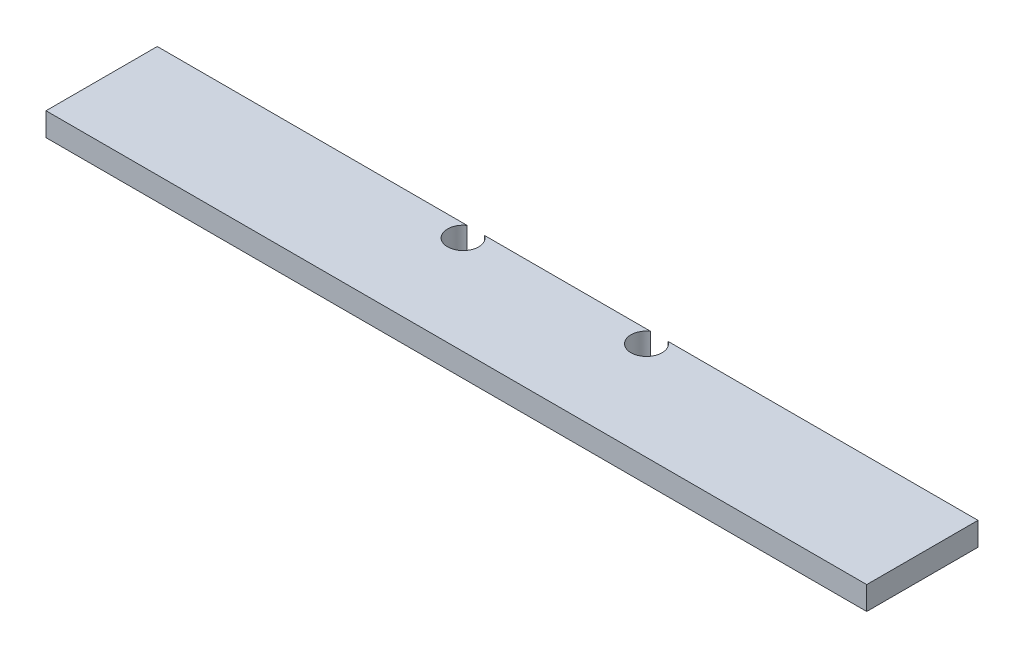
ISO-10303-21;
HEADER;
FILE_DESCRIPTION(('STEP AP214'),'2;1');
FILE_NAME('part.step','',(''),(''),'','','');
FILE_SCHEMA(('AUTOMOTIVE_DESIGN { 1 0 10303 214 1 1 1 1 }'));
ENDSEC;
DATA;
#1=APPLICATION_CONTEXT('core data for automotive mechanical design processes');
#2=APPLICATION_PROTOCOL_DEFINITION('international standard','automotive_design',2000,#1);
#3=PRODUCT_CONTEXT('',#1,'mechanical');
#4=PRODUCT('Part','Part','',(#3));
#5=PRODUCT_RELATED_PRODUCT_CATEGORY('part','',(#4));
#6=PRODUCT_DEFINITION_FORMATION('','',#4);
#7=PRODUCT_DEFINITION_CONTEXT('part definition',#1,'design');
#8=PRODUCT_DEFINITION('design','',#6,#7);
#9=PRODUCT_DEFINITION_SHAPE('','',#8);
#10=(LENGTH_UNIT() NAMED_UNIT(*) SI_UNIT(.MILLI.,.METRE.));
#11=(NAMED_UNIT(*) PLANE_ANGLE_UNIT() SI_UNIT($,.RADIAN.));
#12=(NAMED_UNIT(*) SI_UNIT($,.STERADIAN.) SOLID_ANGLE_UNIT());
#13=UNCERTAINTY_MEASURE_WITH_UNIT(LENGTH_MEASURE(1.E-05),#10,'distance_accuracy_value','');
#14=(GEOMETRIC_REPRESENTATION_CONTEXT(3) GLOBAL_UNCERTAINTY_ASSIGNED_CONTEXT((#13)) GLOBAL_UNIT_ASSIGNED_CONTEXT((#10,
#11,#12)) REPRESENTATION_CONTEXT('',''));
#15=CARTESIAN_POINT('',(0.,0.,0.));
#16=DIRECTION('',(0.,0.,1.));
#17=DIRECTION('',(1.,0.,0.));
#18=AXIS2_PLACEMENT_3D('',#15,#16,#17);
#19=CARTESIAN_POINT('',(0.,19.05,-90.8304));
#20=DIRECTION('',(0.,0.,1.));
#21=DIRECTION('',(1.,0.,0.));
#22=AXIS2_PLACEMENT_3D('',#19,#20,#21);
#23=PLANE('',#22);
#24=DIRECTION('',(-1.,0.,0.));
#25=VECTOR('',#24,1.);
#26=CARTESIAN_POINT('',(0.,19.05,-90.8304));
#27=LINE('',#26,#25);
#28=CARTESIAN_POINT('',(402.644989523099,19.05,-90.8304));
#29=VERTEX_POINT('',#28);
#30=CARTESIAN_POINT('',(267.280010476901,19.05,-90.8304));
#31=VERTEX_POINT('',#30);
#32=EDGE_CURVE('E115',#29,#31,#27,.T.);
#33=ORIENTED_EDGE('',*,*,#32,.F.);
#34=DIRECTION('',(0.,-1.,0.));
#35=VECTOR('',#34,1.);
#36=CARTESIAN_POINT('',(402.644989523099,19.05,-90.8304));
#37=LINE('',#36,#35);
#38=CARTESIAN_POINT('',(402.644989523099,0.,-90.8304));
#39=VERTEX_POINT('',#38);
#40=EDGE_CURVE('E135',#29,#39,#37,.T.);
#41=ORIENTED_EDGE('',*,*,#40,.T.);
#42=DIRECTION('',(-1.,0.,0.));
#43=VECTOR('',#42,1.);
#44=CARTESIAN_POINT('',(0.,0.,-90.8304));
#45=LINE('',#44,#43);
#46=CARTESIAN_POINT('',(267.280010476901,0.,-90.8304));
#47=VERTEX_POINT('',#46);
#48=EDGE_CURVE('E117',#39,#47,#45,.T.);
#49=ORIENTED_EDGE('',*,*,#48,.T.);
#50=DIRECTION('',(0.,-1.,0.));
#51=VECTOR('',#50,1.);
#52=CARTESIAN_POINT('',(267.280010476901,19.05,-90.8304));
#53=LINE('',#52,#51);
#54=EDGE_CURVE('E54',#47,#31,#53,.F.);
#55=ORIENTED_EDGE('',*,*,#54,.T.);
#56=EDGE_LOOP('',(#33,#41,#49,#55));
#57=FACE_BOUND('',#56,.T.);
#58=ADVANCED_FACE('F39',(#57),#23,.F.);
#59=CARTESIAN_POINT('',(252.962789523099,19.05,-90.8304));
#60=VERTEX_POINT('',#59);
#61=CARTESIAN_POINT('',(0.,19.05,-90.8304));
#62=VERTEX_POINT('',#61);
#63=EDGE_CURVE('E124',#60,#62,#27,.T.);
#64=ORIENTED_EDGE('',*,*,#63,.F.);
#65=DIRECTION('',(0.,-1.,0.));
#66=VECTOR('',#65,1.);
#67=CARTESIAN_POINT('',(252.962789523099,19.05,-90.8304));
#68=LINE('',#67,#66);
#69=CARTESIAN_POINT('',(252.962789523099,0.,-90.8304));
#70=VERTEX_POINT('',#69);
#71=EDGE_CURVE('E105',#60,#70,#68,.T.);
#72=ORIENTED_EDGE('',*,*,#71,.T.);
#73=CARTESIAN_POINT('',(0.,0.,-90.8304));
#74=VERTEX_POINT('',#73);
#75=EDGE_CURVE('E139',#70,#74,#45,.T.);
#76=ORIENTED_EDGE('',*,*,#75,.T.);
#77=DIRECTION('',(0.,-1.,0.));
#78=VECTOR('',#77,1.);
#79=CARTESIAN_POINT('',(0.,19.05,-90.8304));
#80=LINE('',#79,#78);
#81=EDGE_CURVE('E126',#62,#74,#80,.T.);
#82=ORIENTED_EDGE('',*,*,#81,.F.);
#83=EDGE_LOOP('',(#64,#72,#76,#82));
#84=FACE_BOUND('',#83,.T.);
#85=ADVANCED_FACE('F177',(#84),#23,.F.);
#86=CARTESIAN_POINT('',(0.,19.05,0.));
#87=DIRECTION('',(1.,0.,0.));
#88=DIRECTION('',(0.,0.,-1.));
#89=AXIS2_PLACEMENT_3D('',#86,#87,#88);
#90=PLANE('',#89);
#91=DIRECTION('',(0.,0.,1.));
#92=VECTOR('',#91,1.);
#93=CARTESIAN_POINT('',(0.,0.,0.));
#94=LINE('',#93,#92);
#95=CARTESIAN_POINT('',(0.,0.,0.));
#96=VERTEX_POINT('',#95);
#97=EDGE_CURVE('E131',#74,#96,#94,.T.);
#98=ORIENTED_EDGE('',*,*,#97,.T.);
#99=DIRECTION('',(0.,-1.,0.));
#100=VECTOR('',#99,1.);
#101=CARTESIAN_POINT('',(0.,19.05,0.));
#102=LINE('',#101,#100);
#103=CARTESIAN_POINT('',(0.,19.05,0.));
#104=VERTEX_POINT('',#103);
#105=EDGE_CURVE('E11',#104,#96,#102,.T.);
#106=ORIENTED_EDGE('',*,*,#105,.F.);
#107=DIRECTION('',(0.,0.,1.));
#108=VECTOR('',#107,1.);
#109=CARTESIAN_POINT('',(0.,19.05,0.));
#110=LINE('',#109,#108);
#111=EDGE_CURVE('E143',#62,#104,#110,.T.);
#112=ORIENTED_EDGE('',*,*,#111,.F.);
#113=ORIENTED_EDGE('',*,*,#81,.T.);
#114=EDGE_LOOP('',(#98,#106,#112,#113));
#115=FACE_BOUND('',#114,.T.);
#116=ADVANCED_FACE('F41',(#115),#90,.F.);
#117=CARTESIAN_POINT('',(0.,19.05,0.));
#118=DIRECTION('',(0.,0.,-1.));
#119=DIRECTION('',(-1.,0.,0.));
#120=AXIS2_PLACEMENT_3D('',#117,#118,#119);
#121=PLANE('',#120);
#122=DIRECTION('',(1.,0.,0.));
#123=VECTOR('',#122,1.);
#124=CARTESIAN_POINT('',(0.,0.,0.));
#125=LINE('',#124,#123);
#126=CARTESIAN_POINT('',(669.925,0.,0.));
#127=VERTEX_POINT('',#126);
#128=EDGE_CURVE('E134',#96,#127,#125,.T.);
#129=ORIENTED_EDGE('',*,*,#128,.T.);
#130=DIRECTION('',(0.,-1.,0.));
#131=VECTOR('',#130,1.);
#132=CARTESIAN_POINT('',(669.925,19.05,0.));
#133=LINE('',#132,#131);
#134=CARTESIAN_POINT('',(669.925,19.05,0.));
#135=VERTEX_POINT('',#134);
#136=EDGE_CURVE('E47',#135,#127,#133,.T.);
#137=ORIENTED_EDGE('',*,*,#136,.F.);
#138=DIRECTION('',(1.,0.,0.));
#139=VECTOR('',#138,1.);
#140=CARTESIAN_POINT('',(0.,19.05,0.));
#141=LINE('',#140,#139);
#142=EDGE_CURVE('E165',#104,#135,#141,.T.);
#143=ORIENTED_EDGE('',*,*,#142,.F.);
#144=ORIENTED_EDGE('',*,*,#105,.T.);
#145=EDGE_LOOP('',(#129,#137,#143,#144));
#146=FACE_BOUND('',#145,.T.);
#147=ADVANCED_FACE('F181',(#146),#121,.F.);
#148=CARTESIAN_POINT('',(669.925,19.05,0.));
#149=DIRECTION('',(-1.,0.,0.));
#150=DIRECTION('',(0.,0.,1.));
#151=AXIS2_PLACEMENT_3D('',#148,#149,#150);
#152=PLANE('',#151);
#153=DIRECTION('',(0.,0.,-1.));
#154=VECTOR('',#153,1.);
#155=CARTESIAN_POINT('',(669.925,0.,0.));
#156=LINE('',#155,#154);
#157=CARTESIAN_POINT('',(669.925,0.,-90.8304));
#158=VERTEX_POINT('',#157);
#159=EDGE_CURVE('E137',#127,#158,#156,.T.);
#160=ORIENTED_EDGE('',*,*,#159,.T.);
#161=DIRECTION('',(0.,-1.,0.));
#162=VECTOR('',#161,1.);
#163=CARTESIAN_POINT('',(669.925,19.05,-90.8304));
#164=LINE('',#163,#162);
#165=CARTESIAN_POINT('',(669.925,19.05,-90.8304));
#166=VERTEX_POINT('',#165);
#167=EDGE_CURVE('E146',#166,#158,#164,.T.);
#168=ORIENTED_EDGE('',*,*,#167,.F.);
#169=DIRECTION('',(0.,0.,-1.));
#170=VECTOR('',#169,1.);
#171=CARTESIAN_POINT('',(669.925,19.05,0.));
#172=LINE('',#171,#170);
#173=EDGE_CURVE('E127',#135,#166,#172,.T.);
#174=ORIENTED_EDGE('',*,*,#173,.F.);
#175=ORIENTED_EDGE('',*,*,#136,.T.);
#176=EDGE_LOOP('',(#160,#168,#174,#175));
#177=FACE_BOUND('',#176,.T.);
#178=ADVANCED_FACE('F153',(#177),#152,.F.);
#179=CARTESIAN_POINT('',(416.962210476901,0.,-90.8304));
#180=VERTEX_POINT('',#179);
#181=EDGE_CURVE('E140',#158,#180,#45,.T.);
#182=ORIENTED_EDGE('',*,*,#181,.T.);
#183=DIRECTION('',(0.,-1.,0.));
#184=VECTOR('',#183,1.);
#185=CARTESIAN_POINT('',(416.962210476901,19.05,-90.8304));
#186=LINE('',#185,#184);
#187=CARTESIAN_POINT('',(416.962210476901,19.05,-90.8304));
#188=VERTEX_POINT('',#187);
#189=EDGE_CURVE('E62',#180,#188,#186,.F.);
#190=ORIENTED_EDGE('',*,*,#189,.T.);
#191=EDGE_CURVE('E123',#166,#188,#27,.T.);
#192=ORIENTED_EDGE('',*,*,#191,.F.);
#193=ORIENTED_EDGE('',*,*,#167,.T.);
#194=EDGE_LOOP('',(#182,#190,#192,#193));
#195=FACE_BOUND('',#194,.T.);
#196=ADVANCED_FACE('F162',(#195),#23,.F.);
#197=CARTESIAN_POINT('',(0.,19.05,0.));
#198=DIRECTION('',(0.,-1.,0.));
#199=DIRECTION('',(0.,0.,-1.));
#200=AXIS2_PLACEMENT_3D('',#197,#198,#199);
#201=PLANE('',#200);
#202=ORIENTED_EDGE('',*,*,#191,.T.);
#203=CARTESIAN_POINT('',(409.8036,19.05,-80.3402));
#204=DIRECTION('',(0.,-1.,0.));
#205=DIRECTION('',(0.,0.,-1.));
#206=AXIS2_PLACEMENT_3D('',#203,#204,#205);
#207=CIRCLE('',#206,12.7);
#208=EDGE_CURVE('E118',#188,#29,#207,.T.);
#209=ORIENTED_EDGE('',*,*,#208,.T.);
#210=ORIENTED_EDGE('',*,*,#32,.T.);
#211=CARTESIAN_POINT('',(260.1214,19.05,-80.3402));
#212=DIRECTION('',(0.,-1.,0.));
#213=DIRECTION('',(0.,0.,-1.));
#214=AXIS2_PLACEMENT_3D('',#211,#212,#213);
#215=CIRCLE('',#214,12.7);
#216=EDGE_CURVE('E102',#31,#60,#215,.T.);
#217=ORIENTED_EDGE('',*,*,#216,.T.);
#218=ORIENTED_EDGE('',*,*,#63,.T.);
#219=ORIENTED_EDGE('',*,*,#111,.T.);
#220=ORIENTED_EDGE('',*,*,#142,.T.);
#221=ORIENTED_EDGE('',*,*,#173,.T.);
#222=EDGE_LOOP('',(#202,#209,#210,#217,#218,#219,#220,#221));
#223=FACE_BOUND('',#222,.T.);
#224=ADVANCED_FACE('F122',(#223),#201,.F.);
#225=CARTESIAN_POINT('',(0.,0.,0.));
#226=DIRECTION('',(0.,-1.,0.));
#227=DIRECTION('',(0.,0.,-1.));
#228=AXIS2_PLACEMENT_3D('',#225,#226,#227);
#229=PLANE('',#228);
#230=CARTESIAN_POINT('',(409.8036,0.,-80.3402));
#231=DIRECTION('',(0.,-1.,0.));
#232=DIRECTION('',(0.,0.,-1.));
#233=AXIS2_PLACEMENT_3D('',#230,#231,#232);
#234=CIRCLE('',#233,12.7);
#235=EDGE_CURVE('E160',#180,#39,#234,.T.);
#236=ORIENTED_EDGE('',*,*,#235,.F.);
#237=ORIENTED_EDGE('',*,*,#181,.F.);
#238=ORIENTED_EDGE('',*,*,#159,.F.);
#239=ORIENTED_EDGE('',*,*,#128,.F.);
#240=ORIENTED_EDGE('',*,*,#97,.F.);
#241=ORIENTED_EDGE('',*,*,#75,.F.);
#242=CARTESIAN_POINT('',(260.1214,0.,-80.3402));
#243=DIRECTION('',(0.,-1.,0.));
#244=DIRECTION('',(0.,0.,-1.));
#245=AXIS2_PLACEMENT_3D('',#242,#243,#244);
#246=CIRCLE('',#245,12.7);
#247=EDGE_CURVE('E109',#47,#70,#246,.T.);
#248=ORIENTED_EDGE('',*,*,#247,.F.);
#249=ORIENTED_EDGE('',*,*,#48,.F.);
#250=EDGE_LOOP('',(#236,#237,#238,#239,#240,#241,#248,#249));
#251=FACE_BOUND('',#250,.T.);
#252=ADVANCED_FACE('F158',(#251),#229,.T.);
#253=CARTESIAN_POINT('',(260.1214,19.05,-80.3402));
#254=DIRECTION('',(0.,-1.,0.));
#255=DIRECTION('',(0.,0.,-1.));
#256=AXIS2_PLACEMENT_3D('',#253,#254,#255);
#257=CYLINDRICAL_SURFACE('',#256,12.7);
#258=ORIENTED_EDGE('',*,*,#216,.F.);
#259=ORIENTED_EDGE('',*,*,#54,.F.);
#260=ORIENTED_EDGE('',*,*,#247,.T.);
#261=ORIENTED_EDGE('',*,*,#71,.F.);
#262=EDGE_LOOP('',(#258,#259,#260,#261));
#263=FACE_BOUND('',#262,.T.);
#264=ADVANCED_FACE('F103',(#263),#257,.F.);
#265=CARTESIAN_POINT('',(409.8036,19.05,-80.3402));
#266=DIRECTION('',(0.,-1.,0.));
#267=DIRECTION('',(0.,0.,-1.));
#268=AXIS2_PLACEMENT_3D('',#265,#266,#267);
#269=CYLINDRICAL_SURFACE('',#268,12.7);
#270=ORIENTED_EDGE('',*,*,#208,.F.);
#271=ORIENTED_EDGE('',*,*,#189,.F.);
#272=ORIENTED_EDGE('',*,*,#235,.T.);
#273=ORIENTED_EDGE('',*,*,#40,.F.);
#274=EDGE_LOOP('',(#270,#271,#272,#273));
#275=FACE_BOUND('',#274,.T.);
#276=ADVANCED_FACE('F173',(#275),#269,.F.);
#277=CLOSED_SHELL('',(#58,#85,#116,#147,#178,#196,#224,#252,#264,#276));
#278=MANIFOLD_SOLID_BREP('B2',#277);
#279=ADVANCED_BREP_SHAPE_REPRESENTATION('',(#18,#278),#14);
#280=SHAPE_DEFINITION_REPRESENTATION(#9,#279);
ENDSEC;
END-ISO-10303-21;
